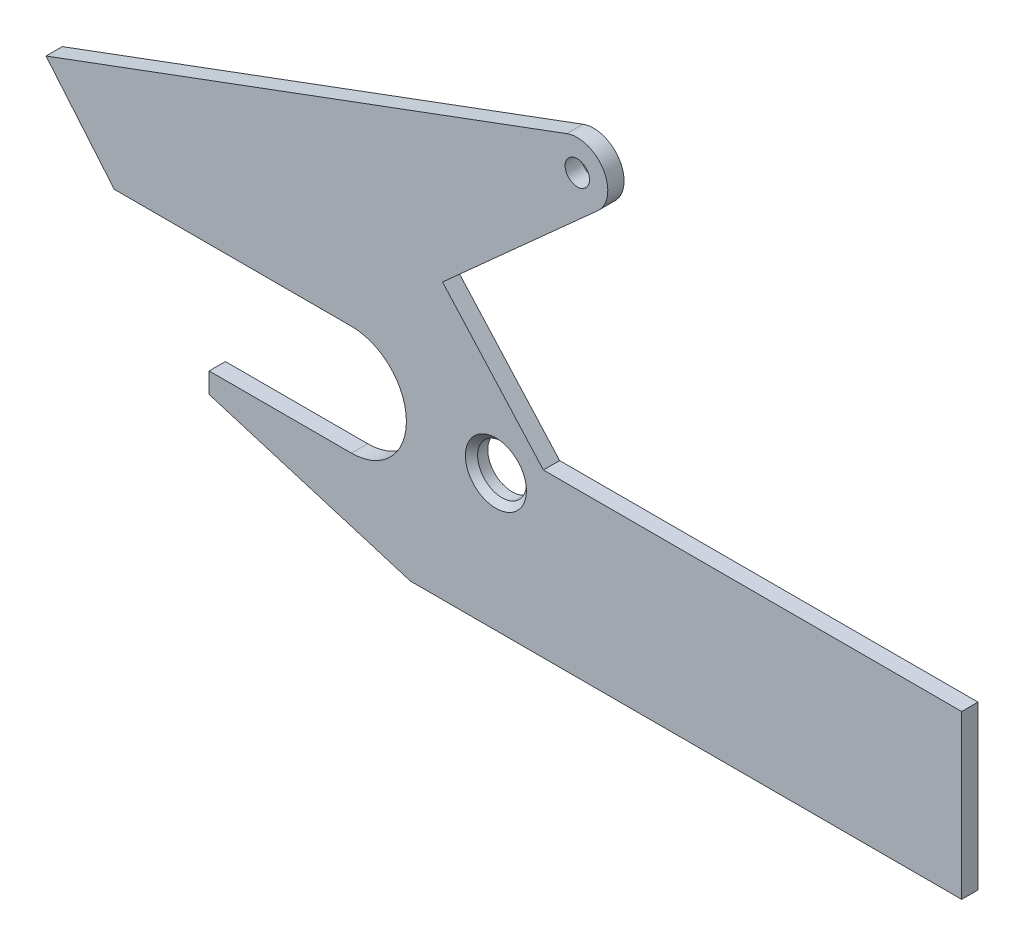
ISO-10303-21;
HEADER;
FILE_DESCRIPTION(('STEP AP214'),'2;1');
FILE_NAME('part.step','',(''),(''),'','','');
FILE_SCHEMA(('AUTOMOTIVE_DESIGN { 1 0 10303 214 1 1 1 1 }'));
ENDSEC;
DATA;
#1=APPLICATION_CONTEXT('core data for automotive mechanical design processes');
#2=APPLICATION_PROTOCOL_DEFINITION('international standard','automotive_design',2000,#1);
#3=PRODUCT_CONTEXT('',#1,'mechanical');
#4=PRODUCT('Part','Part','',(#3));
#5=PRODUCT_RELATED_PRODUCT_CATEGORY('part','',(#4));
#6=PRODUCT_DEFINITION_FORMATION('','',#4);
#7=PRODUCT_DEFINITION_CONTEXT('part definition',#1,'design');
#8=PRODUCT_DEFINITION('design','',#6,#7);
#9=PRODUCT_DEFINITION_SHAPE('','',#8);
#10=(LENGTH_UNIT() NAMED_UNIT(*) SI_UNIT(.MILLI.,.METRE.));
#11=(NAMED_UNIT(*) PLANE_ANGLE_UNIT() SI_UNIT($,.RADIAN.));
#12=(NAMED_UNIT(*) SI_UNIT($,.STERADIAN.) SOLID_ANGLE_UNIT());
#13=UNCERTAINTY_MEASURE_WITH_UNIT(LENGTH_MEASURE(1.E-05),#10,'distance_accuracy_value','');
#14=(GEOMETRIC_REPRESENTATION_CONTEXT(3) GLOBAL_UNCERTAINTY_ASSIGNED_CONTEXT((#13)) GLOBAL_UNIT_ASSIGNED_CONTEXT((#10,
#11,#12)) REPRESENTATION_CONTEXT('',''));
#15=CARTESIAN_POINT('',(0.,0.,0.));
#16=DIRECTION('',(0.,0.,1.));
#17=DIRECTION('',(1.,0.,0.));
#18=AXIS2_PLACEMENT_3D('',#15,#16,#17);
#19=CARTESIAN_POINT('',(55.4999999999125,73.9348675534564,4.));
#20=DIRECTION('',(0.,0.,1.));
#21=DIRECTION('',(1.,0.,0.));
#22=AXIS2_PLACEMENT_3D('',#19,#20,#21);
#23=PLANE('',#22);
#24=CARTESIAN_POINT('',(35.5,0.,4.));
#25=DIRECTION('',(0.,0.,1.));
#26=DIRECTION('',(1.,0.,0.));
#27=AXIS2_PLACEMENT_3D('',#24,#25,#26);
#28=CIRCLE('',#27,7.49999999999998);
#29=CARTESIAN_POINT('',(43.,0.,4.));
#30=VERTEX_POINT('',#29);
#31=EDGE_CURVE('E11',#30,#30,#28,.F.);
#32=ORIENTED_EDGE('',*,*,#31,.T.);
#33=EDGE_LOOP('',(#32));
#34=FACE_BOUND('',#33,.T.);
#35=CARTESIAN_POINT('',(55.4999999999125,73.9348675534564,4.));
#36=DIRECTION('',(0.,0.,1.));
#37=DIRECTION('',(1.,0.,0.));
#38=AXIS2_PLACEMENT_3D('',#35,#36,#37);
#39=CIRCLE('',#38,3.);
#40=CARTESIAN_POINT('',(58.4999999999125,73.9348675534564,4.));
#41=VERTEX_POINT('',#40);
#42=EDGE_CURVE('E169',#41,#41,#39,.T.);
#43=ORIENTED_EDGE('',*,*,#42,.F.);
#44=EDGE_LOOP('',(#43));
#45=FACE_BOUND('',#44,.T.);
#46=CARTESIAN_POINT('',(55.4999999999125,73.9348675534564,4.));
#47=DIRECTION('',(0.,0.,1.));
#48=DIRECTION('',(1.,0.,0.));
#49=AXIS2_PLACEMENT_3D('',#46,#47,#48);
#50=CIRCLE('',#49,7.50000000000001);
#51=CARTESIAN_POINT('',(60.5098617885871,68.3535339441495,4.));
#52=VERTEX_POINT('',#51);
#53=CARTESIAN_POINT('',(52.8919610956102,80.9668042051652,4.));
#54=VERTEX_POINT('',#53);
#55=EDGE_CURVE('E190',#52,#54,#50,.T.);
#56=ORIENTED_EDGE('',*,*,#55,.T.);
#57=DIRECTION('',(-0.937591553564827,-0.347738520563792,0.));
#58=VECTOR('',#57,1.);
#59=CARTESIAN_POINT('',(-75.0906237078958,33.4999999999755,4.));
#60=LINE('',#59,#58);
#61=CARTESIAN_POINT('',(-75.0906237078958,33.4999999999755,4.));
#62=VERTEX_POINT('',#61);
#63=EDGE_CURVE('E114',#54,#62,#60,.T.);
#64=ORIENTED_EDGE('',*,*,#63,.T.);
#65=DIRECTION('',(0.642787609686544,-0.766044443118974,0.));
#66=VECTOR('',#65,1.);
#67=CARTESIAN_POINT('',(-58.3086310843706,13.5000000000001,4.));
#68=LINE('',#67,#66);
#69=CARTESIAN_POINT('',(-58.3086310843706,13.5000000000001,4.));
#70=VERTEX_POINT('',#69);
#71=EDGE_CURVE('E301',#62,#70,#68,.T.);
#72=ORIENTED_EDGE('',*,*,#71,.T.);
#73=DIRECTION('',(1.,0.,0.));
#74=VECTOR('',#73,1.);
#75=CARTESIAN_POINT('',(0.,13.5,4.));
#76=LINE('',#75,#74);
#77=CARTESIAN_POINT('',(0.,13.5,4.));
#78=VERTEX_POINT('',#77);
#79=EDGE_CURVE('E303',#70,#78,#76,.T.);
#80=ORIENTED_EDGE('',*,*,#79,.T.);
#81=CARTESIAN_POINT('',(0.,0.,4.));
#82=DIRECTION('',(0.,0.,-1.));
#83=DIRECTION('',(1.,0.,0.));
#84=AXIS2_PLACEMENT_3D('',#81,#82,#83);
#85=CIRCLE('',#84,13.5);
#86=CARTESIAN_POINT('',(-2.27179386413923E-11,-13.5,4.));
#87=VERTEX_POINT('',#86);
#88=EDGE_CURVE('E305',#78,#87,#85,.T.);
#89=ORIENTED_EDGE('',*,*,#88,.T.);
#90=DIRECTION('',(-1.,0.,0.));
#91=VECTOR('',#90,1.);
#92=CARTESIAN_POINT('',(-35.,-13.5,4.));
#93=LINE('',#92,#91);
#94=CARTESIAN_POINT('',(-35.,-13.5,4.));
#95=VERTEX_POINT('',#94);
#96=EDGE_CURVE('E311',#87,#95,#93,.T.);
#97=ORIENTED_EDGE('',*,*,#96,.T.);
#98=DIRECTION('',(0.,-1.,0.));
#99=VECTOR('',#98,1.);
#100=CARTESIAN_POINT('',(-35.,-18.5,4.));
#101=LINE('',#100,#99);
#102=CARTESIAN_POINT('',(-35.,-18.5,4.));
#103=VERTEX_POINT('',#102);
#104=EDGE_CURVE('E313',#95,#103,#101,.T.);
#105=ORIENTED_EDGE('',*,*,#104,.T.);
#106=DIRECTION('',(0.957024404433605,-0.290007395282436,0.));
#107=VECTOR('',#106,1.);
#108=CARTESIAN_POINT('',(14.5,-33.4999999999754,4.));
#109=LINE('',#108,#107);
#110=CARTESIAN_POINT('',(14.5,-33.4999999999754,4.));
#111=VERTEX_POINT('',#110);
#112=EDGE_CURVE('E315',#103,#111,#109,.T.);
#113=ORIENTED_EDGE('',*,*,#112,.T.);
#114=DIRECTION('',(1.,1.80872127443545E-13,0.));
#115=VECTOR('',#114,1.);
#116=CARTESIAN_POINT('',(150.,-33.4999999999509,4.));
#117=LINE('',#116,#115);
#118=CARTESIAN_POINT('',(150.,-33.4999999999509,4.));
#119=VERTEX_POINT('',#118);
#120=EDGE_CURVE('E317',#111,#119,#117,.T.);
#121=ORIENTED_EDGE('',*,*,#120,.T.);
#122=DIRECTION('',(0.,1.,0.));
#123=VECTOR('',#122,1.);
#124=CARTESIAN_POINT('',(150.,6.50000000004908,4.));
#125=LINE('',#124,#123);
#126=CARTESIAN_POINT('',(150.,6.50000000004908,4.));
#127=VERTEX_POINT('',#126);
#128=EDGE_CURVE('E147',#119,#127,#125,.T.);
#129=ORIENTED_EDGE('',*,*,#128,.T.);
#130=DIRECTION('',(-1.,-2.38340446838385E-13,0.));
#131=VECTOR('',#130,1.);
#132=CARTESIAN_POINT('',(47.1715728752539,6.50000000002457,4.));
#133=LINE('',#132,#131);
#134=CARTESIAN_POINT('',(47.1715728752539,6.50000000002457,4.));
#135=VERTEX_POINT('',#134);
#136=EDGE_CURVE('E142',#127,#135,#133,.T.);
#137=ORIENTED_EDGE('',*,*,#136,.T.);
#138=DIRECTION('',(-0.667981571845495,0.744177814554305,0.));
#139=VECTOR('',#138,1.);
#140=CARTESIAN_POINT('',(22.3758988581383,34.1241011402371,4.));
#141=LINE('',#140,#139);
#142=CARTESIAN_POINT('',(22.3758988581383,34.1241011402371,4.));
#143=VERTEX_POINT('',#142);
#144=EDGE_CURVE('E145',#135,#143,#141,.T.);
#145=ORIENTED_EDGE('',*,*,#144,.T.);
#146=DIRECTION('',(0.74417781457425,0.667981571823274,0.));
#147=VECTOR('',#146,1.);
#148=CARTESIAN_POINT('',(60.5098617885871,68.3535339441495,4.));
#149=LINE('',#148,#147);
#150=EDGE_CURVE('E55',#143,#52,#149,.T.);
#151=ORIENTED_EDGE('',*,*,#150,.T.);
#152=EDGE_LOOP('',(#56,#64,#72,#80,#89,#97,#105,#113,#121,#129,#137,#145,#151));
#153=FACE_BOUND('',#152,.T.);
#154=ADVANCED_FACE('F38',(#34,#45,#153),#23,.T.);
#155=CARTESIAN_POINT('',(55.4999999999125,73.9348675534564,0.));
#156=DIRECTION('',(0.,0.,1.));
#157=DIRECTION('',(1.,0.,0.));
#158=AXIS2_PLACEMENT_3D('',#155,#156,#157);
#159=PLANE('',#158);
#160=CARTESIAN_POINT('',(55.4999999999125,73.9348675534564,0.));
#161=DIRECTION('',(0.,0.,1.));
#162=DIRECTION('',(1.,0.,0.));
#163=AXIS2_PLACEMENT_3D('',#160,#161,#162);
#164=CIRCLE('',#163,7.50000000000001);
#165=CARTESIAN_POINT('',(60.5098617885871,68.3535339441495,0.));
#166=VERTEX_POINT('',#165);
#167=CARTESIAN_POINT('',(52.8919610956102,80.9668042051652,0.));
#168=VERTEX_POINT('',#167);
#169=EDGE_CURVE('E165',#166,#168,#164,.T.);
#170=ORIENTED_EDGE('',*,*,#169,.F.);
#171=DIRECTION('',(0.74417781457425,0.667981571823274,0.));
#172=VECTOR('',#171,1.);
#173=CARTESIAN_POINT('',(60.5098617885871,68.3535339441495,0.));
#174=LINE('',#173,#172);
#175=CARTESIAN_POINT('',(22.3758988581383,34.1241011402371,0.));
#176=VERTEX_POINT('',#175);
#177=EDGE_CURVE('E105',#176,#166,#174,.T.);
#178=ORIENTED_EDGE('',*,*,#177,.F.);
#179=DIRECTION('',(-0.667981571845495,0.744177814554305,0.));
#180=VECTOR('',#179,1.);
#181=CARTESIAN_POINT('',(22.3758988581383,34.1241011402371,0.));
#182=LINE('',#181,#180);
#183=CARTESIAN_POINT('',(47.1715728752539,6.50000000002457,0.));
#184=VERTEX_POINT('',#183);
#185=EDGE_CURVE('E99',#184,#176,#182,.T.);
#186=ORIENTED_EDGE('',*,*,#185,.F.);
#187=DIRECTION('',(-1.,-2.38340446838385E-13,0.));
#188=VECTOR('',#187,1.);
#189=CARTESIAN_POINT('',(47.1715728752539,6.50000000002457,0.));
#190=LINE('',#189,#188);
#191=CARTESIAN_POINT('',(150.,6.50000000004908,0.));
#192=VERTEX_POINT('',#191);
#193=EDGE_CURVE('E155',#192,#184,#190,.T.);
#194=ORIENTED_EDGE('',*,*,#193,.F.);
#195=DIRECTION('',(0.,1.,0.));
#196=VECTOR('',#195,1.);
#197=CARTESIAN_POINT('',(150.,6.50000000004908,0.));
#198=LINE('',#197,#196);
#199=CARTESIAN_POINT('',(150.,-33.4999999999509,0.));
#200=VERTEX_POINT('',#199);
#201=EDGE_CURVE('E185',#200,#192,#198,.T.);
#202=ORIENTED_EDGE('',*,*,#201,.F.);
#203=DIRECTION('',(1.,1.80872127443545E-13,0.));
#204=VECTOR('',#203,1.);
#205=CARTESIAN_POINT('',(150.,-33.4999999999509,0.));
#206=LINE('',#205,#204);
#207=CARTESIAN_POINT('',(14.5,-33.4999999999754,0.));
#208=VERTEX_POINT('',#207);
#209=EDGE_CURVE('E183',#208,#200,#206,.T.);
#210=ORIENTED_EDGE('',*,*,#209,.F.);
#211=DIRECTION('',(0.957024404433605,-0.290007395282436,0.));
#212=VECTOR('',#211,1.);
#213=CARTESIAN_POINT('',(14.5,-33.4999999999754,0.));
#214=LINE('',#213,#212);
#215=CARTESIAN_POINT('',(-35.,-18.5,0.));
#216=VERTEX_POINT('',#215);
#217=EDGE_CURVE('E181',#216,#208,#214,.T.);
#218=ORIENTED_EDGE('',*,*,#217,.F.);
#219=DIRECTION('',(0.,-1.,0.));
#220=VECTOR('',#219,1.);
#221=CARTESIAN_POINT('',(-35.,-18.5,0.));
#222=LINE('',#221,#220);
#223=CARTESIAN_POINT('',(-35.,-13.5,0.));
#224=VERTEX_POINT('',#223);
#225=EDGE_CURVE('E179',#224,#216,#222,.T.);
#226=ORIENTED_EDGE('',*,*,#225,.F.);
#227=DIRECTION('',(-1.,0.,0.));
#228=VECTOR('',#227,1.);
#229=CARTESIAN_POINT('',(-35.,-13.5,0.));
#230=LINE('',#229,#228);
#231=CARTESIAN_POINT('',(-2.27179386413923E-11,-13.5,0.));
#232=VERTEX_POINT('',#231);
#233=EDGE_CURVE('E177',#232,#224,#230,.T.);
#234=ORIENTED_EDGE('',*,*,#233,.F.);
#235=CARTESIAN_POINT('',(0.,0.,0.));
#236=DIRECTION('',(0.,0.,-1.));
#237=DIRECTION('',(1.,0.,0.));
#238=AXIS2_PLACEMENT_3D('',#235,#236,#237);
#239=CIRCLE('',#238,13.5);
#240=CARTESIAN_POINT('',(0.,13.5,0.));
#241=VERTEX_POINT('',#240);
#242=EDGE_CURVE('E175',#241,#232,#239,.T.);
#243=ORIENTED_EDGE('',*,*,#242,.F.);
#244=DIRECTION('',(1.,0.,0.));
#245=VECTOR('',#244,1.);
#246=CARTESIAN_POINT('',(0.,13.5,0.));
#247=LINE('',#246,#245);
#248=CARTESIAN_POINT('',(-58.3086310843706,13.5000000000001,0.));
#249=VERTEX_POINT('',#248);
#250=EDGE_CURVE('E173',#249,#241,#247,.T.);
#251=ORIENTED_EDGE('',*,*,#250,.F.);
#252=DIRECTION('',(0.642787609686544,-0.766044443118974,0.));
#253=VECTOR('',#252,1.);
#254=CARTESIAN_POINT('',(-58.3086310843706,13.5000000000001,0.));
#255=LINE('',#254,#253);
#256=CARTESIAN_POINT('',(-75.0906237078958,33.4999999999755,0.));
#257=VERTEX_POINT('',#256);
#258=EDGE_CURVE('E171',#257,#249,#255,.T.);
#259=ORIENTED_EDGE('',*,*,#258,.F.);
#260=DIRECTION('',(-0.937591553564827,-0.347738520563792,0.));
#261=VECTOR('',#260,1.);
#262=CARTESIAN_POINT('',(-75.0906237078958,33.4999999999755,0.));
#263=LINE('',#262,#261);
#264=EDGE_CURVE('E168',#168,#257,#263,.T.);
#265=ORIENTED_EDGE('',*,*,#264,.F.);
#266=EDGE_LOOP('',(#170,#178,#186,#194,#202,#210,#218,#226,#234,#243,#251,#259,#265));
#267=FACE_BOUND('',#266,.T.);
#268=CARTESIAN_POINT('',(55.4999999999125,73.9348675534564,0.));
#269=DIRECTION('',(0.,0.,1.));
#270=DIRECTION('',(1.,0.,0.));
#271=AXIS2_PLACEMENT_3D('',#268,#269,#270);
#272=CIRCLE('',#271,3.);
#273=CARTESIAN_POINT('',(58.4999999999125,73.9348675534564,0.));
#274=VERTEX_POINT('',#273);
#275=EDGE_CURVE('E336',#274,#274,#272,.T.);
#276=ORIENTED_EDGE('',*,*,#275,.T.);
#277=EDGE_LOOP('',(#276));
#278=FACE_BOUND('',#277,.T.);
#279=CARTESIAN_POINT('',(35.5,0.,0.));
#280=DIRECTION('',(0.,0.,1.));
#281=DIRECTION('',(1.,0.,0.));
#282=AXIS2_PLACEMENT_3D('',#279,#280,#281);
#283=CIRCLE('',#282,6.);
#284=CARTESIAN_POINT('',(41.5,0.,0.));
#285=VERTEX_POINT('',#284);
#286=EDGE_CURVE('E339',#285,#285,#283,.T.);
#287=ORIENTED_EDGE('',*,*,#286,.T.);
#288=EDGE_LOOP('',(#287));
#289=FACE_BOUND('',#288,.T.);
#290=ADVANCED_FACE('F235',(#267,#278,#289),#159,.F.);
#291=CARTESIAN_POINT('',(55.4999999999125,73.9348675534564,4.));
#292=DIRECTION('',(0.,0.,-1.));
#293=DIRECTION('',(-1.,0.,0.));
#294=AXIS2_PLACEMENT_3D('',#291,#292,#293);
#295=CYLINDRICAL_SURFACE('',#294,7.50000000000001);
#296=ORIENTED_EDGE('',*,*,#169,.T.);
#297=DIRECTION('',(0.,0.,-1.));
#298=VECTOR('',#297,1.);
#299=CARTESIAN_POINT('',(52.8919610956102,80.9668042051652,4.));
#300=LINE('',#299,#298);
#301=EDGE_CURVE('E218',#54,#168,#300,.T.);
#302=ORIENTED_EDGE('',*,*,#301,.F.);
#303=ORIENTED_EDGE('',*,*,#55,.F.);
#304=DIRECTION('',(0.,0.,-1.));
#305=VECTOR('',#304,1.);
#306=CARTESIAN_POINT('',(60.5098617885871,68.3535339441495,4.));
#307=LINE('',#306,#305);
#308=EDGE_CURVE('E161',#52,#166,#307,.T.);
#309=ORIENTED_EDGE('',*,*,#308,.T.);
#310=EDGE_LOOP('',(#296,#302,#303,#309));
#311=FACE_BOUND('',#310,.T.);
#312=ADVANCED_FACE('F242',(#311),#295,.T.);
#313=CARTESIAN_POINT('',(-75.0906237078958,33.4999999999755,4.));
#314=DIRECTION('',(0.347738520563792,-0.937591553564827,0.));
#315=DIRECTION('',(0.937591553564827,0.347738520563792,0.));
#316=AXIS2_PLACEMENT_3D('',#313,#314,#315);
#317=PLANE('',#316);
#318=ORIENTED_EDGE('',*,*,#264,.T.);
#319=DIRECTION('',(0.,0.,-1.));
#320=VECTOR('',#319,1.);
#321=CARTESIAN_POINT('',(-75.0906237078958,33.4999999999755,4.));
#322=LINE('',#321,#320);
#323=EDGE_CURVE('E215',#62,#257,#322,.T.);
#324=ORIENTED_EDGE('',*,*,#323,.F.);
#325=ORIENTED_EDGE('',*,*,#63,.F.);
#326=ORIENTED_EDGE('',*,*,#301,.T.);
#327=EDGE_LOOP('',(#318,#324,#325,#326));
#328=FACE_BOUND('',#327,.T.);
#329=ADVANCED_FACE('F286',(#328),#317,.F.);
#330=CARTESIAN_POINT('',(-58.3086310843706,13.5000000000001,4.));
#331=DIRECTION('',(0.766044443118974,0.642787609686544,0.));
#332=DIRECTION('',(-0.642787609686544,0.766044443118974,0.));
#333=AXIS2_PLACEMENT_3D('',#330,#331,#332);
#334=PLANE('',#333);
#335=ORIENTED_EDGE('',*,*,#258,.T.);
#336=DIRECTION('',(0.,0.,-1.));
#337=VECTOR('',#336,1.);
#338=CARTESIAN_POINT('',(-58.3086310843706,13.5000000000001,4.));
#339=LINE('',#338,#337);
#340=EDGE_CURVE('E212',#70,#249,#339,.T.);
#341=ORIENTED_EDGE('',*,*,#340,.F.);
#342=ORIENTED_EDGE('',*,*,#71,.F.);
#343=ORIENTED_EDGE('',*,*,#323,.T.);
#344=EDGE_LOOP('',(#335,#341,#342,#343));
#345=FACE_BOUND('',#344,.T.);
#346=ADVANCED_FACE('F282',(#345),#334,.F.);
#347=CARTESIAN_POINT('',(0.,13.5,4.));
#348=DIRECTION('',(0.,1.,0.));
#349=DIRECTION('',(-1.,0.,0.));
#350=AXIS2_PLACEMENT_3D('',#347,#348,#349);
#351=PLANE('',#350);
#352=ORIENTED_EDGE('',*,*,#250,.T.);
#353=DIRECTION('',(0.,0.,-1.));
#354=VECTOR('',#353,1.);
#355=CARTESIAN_POINT('',(0.,13.5,4.));
#356=LINE('',#355,#354);
#357=EDGE_CURVE('E209',#78,#241,#356,.T.);
#358=ORIENTED_EDGE('',*,*,#357,.F.);
#359=ORIENTED_EDGE('',*,*,#79,.F.);
#360=ORIENTED_EDGE('',*,*,#340,.T.);
#361=EDGE_LOOP('',(#352,#358,#359,#360));
#362=FACE_BOUND('',#361,.T.);
#363=ADVANCED_FACE('F278',(#362),#351,.F.);
#364=CARTESIAN_POINT('',(0.,0.,4.));
#365=DIRECTION('',(0.,0.,-1.));
#366=DIRECTION('',(-1.,0.,0.));
#367=AXIS2_PLACEMENT_3D('',#364,#365,#366);
#368=CYLINDRICAL_SURFACE('',#367,13.5);
#369=ORIENTED_EDGE('',*,*,#242,.T.);
#370=DIRECTION('',(0.,0.,-1.));
#371=VECTOR('',#370,1.);
#372=CARTESIAN_POINT('',(-2.27179386413923E-11,-13.5,4.));
#373=LINE('',#372,#371);
#374=EDGE_CURVE('E206',#87,#232,#373,.T.);
#375=ORIENTED_EDGE('',*,*,#374,.F.);
#376=ORIENTED_EDGE('',*,*,#88,.F.);
#377=ORIENTED_EDGE('',*,*,#357,.T.);
#378=EDGE_LOOP('',(#369,#375,#376,#377));
#379=FACE_BOUND('',#378,.T.);
#380=ADVANCED_FACE('F274',(#379),#368,.F.);
#381=CARTESIAN_POINT('',(-35.,-13.5,4.));
#382=DIRECTION('',(0.,-1.,0.));
#383=DIRECTION('',(1.,0.,0.));
#384=AXIS2_PLACEMENT_3D('',#381,#382,#383);
#385=PLANE('',#384);
#386=ORIENTED_EDGE('',*,*,#233,.T.);
#387=DIRECTION('',(0.,0.,-1.));
#388=VECTOR('',#387,1.);
#389=CARTESIAN_POINT('',(-35.,-13.5,4.));
#390=LINE('',#389,#388);
#391=EDGE_CURVE('E203',#95,#224,#390,.T.);
#392=ORIENTED_EDGE('',*,*,#391,.F.);
#393=ORIENTED_EDGE('',*,*,#96,.F.);
#394=ORIENTED_EDGE('',*,*,#374,.T.);
#395=EDGE_LOOP('',(#386,#392,#393,#394));
#396=FACE_BOUND('',#395,.T.);
#397=ADVANCED_FACE('F270',(#396),#385,.F.);
#398=CARTESIAN_POINT('',(-35.,-18.5,4.));
#399=DIRECTION('',(1.,0.,0.));
#400=DIRECTION('',(0.,1.,0.));
#401=AXIS2_PLACEMENT_3D('',#398,#399,#400);
#402=PLANE('',#401);
#403=ORIENTED_EDGE('',*,*,#225,.T.);
#404=DIRECTION('',(0.,0.,-1.));
#405=VECTOR('',#404,1.);
#406=CARTESIAN_POINT('',(-35.,-18.5,4.));
#407=LINE('',#406,#405);
#408=EDGE_CURVE('E200',#103,#216,#407,.T.);
#409=ORIENTED_EDGE('',*,*,#408,.F.);
#410=ORIENTED_EDGE('',*,*,#104,.F.);
#411=ORIENTED_EDGE('',*,*,#391,.T.);
#412=EDGE_LOOP('',(#403,#409,#410,#411));
#413=FACE_BOUND('',#412,.T.);
#414=ADVANCED_FACE('F266',(#413),#402,.F.);
#415=CARTESIAN_POINT('',(14.5,-33.4999999999754,4.));
#416=DIRECTION('',(0.290007395282436,0.957024404433605,0.));
#417=DIRECTION('',(-0.957024404433605,0.290007395282436,0.));
#418=AXIS2_PLACEMENT_3D('',#415,#416,#417);
#419=PLANE('',#418);
#420=ORIENTED_EDGE('',*,*,#217,.T.);
#421=DIRECTION('',(0.,0.,-1.));
#422=VECTOR('',#421,1.);
#423=CARTESIAN_POINT('',(14.5,-33.4999999999754,4.));
#424=LINE('',#423,#422);
#425=EDGE_CURVE('E197',#111,#208,#424,.T.);
#426=ORIENTED_EDGE('',*,*,#425,.F.);
#427=ORIENTED_EDGE('',*,*,#112,.F.);
#428=ORIENTED_EDGE('',*,*,#408,.T.);
#429=EDGE_LOOP('',(#420,#426,#427,#428));
#430=FACE_BOUND('',#429,.T.);
#431=ADVANCED_FACE('F262',(#430),#419,.F.);
#432=CARTESIAN_POINT('',(150.,-33.4999999999509,4.));
#433=DIRECTION('',(-1.80872127443545E-13,1.,0.));
#434=DIRECTION('',(-1.,-1.80872127443545E-13,0.));
#435=AXIS2_PLACEMENT_3D('',#432,#433,#434);
#436=PLANE('',#435);
#437=ORIENTED_EDGE('',*,*,#209,.T.);
#438=DIRECTION('',(0.,0.,-1.));
#439=VECTOR('',#438,1.);
#440=CARTESIAN_POINT('',(150.,-33.4999999999509,4.));
#441=LINE('',#440,#439);
#442=EDGE_CURVE('E194',#119,#200,#441,.T.);
#443=ORIENTED_EDGE('',*,*,#442,.F.);
#444=ORIENTED_EDGE('',*,*,#120,.F.);
#445=ORIENTED_EDGE('',*,*,#425,.T.);
#446=EDGE_LOOP('',(#437,#443,#444,#445));
#447=FACE_BOUND('',#446,.T.);
#448=ADVANCED_FACE('F258',(#447),#436,.F.);
#449=CARTESIAN_POINT('',(150.,6.50000000004908,4.));
#450=DIRECTION('',(-1.,0.,0.));
#451=DIRECTION('',(0.,0.,1.));
#452=AXIS2_PLACEMENT_3D('',#449,#450,#451);
#453=PLANE('',#452);
#454=ORIENTED_EDGE('',*,*,#201,.T.);
#455=DIRECTION('',(0.,0.,-1.));
#456=VECTOR('',#455,1.);
#457=CARTESIAN_POINT('',(150.,6.50000000004908,4.));
#458=LINE('',#457,#456);
#459=EDGE_CURVE('E156',#127,#192,#458,.T.);
#460=ORIENTED_EDGE('',*,*,#459,.F.);
#461=ORIENTED_EDGE('',*,*,#128,.F.);
#462=ORIENTED_EDGE('',*,*,#442,.T.);
#463=EDGE_LOOP('',(#454,#460,#461,#462));
#464=FACE_BOUND('',#463,.T.);
#465=ADVANCED_FACE('F255',(#464),#453,.F.);
#466=CARTESIAN_POINT('',(47.1715728752539,6.50000000002457,4.));
#467=DIRECTION('',(2.38340446838385E-13,-1.,0.));
#468=DIRECTION('',(1.,2.38340446838385E-13,0.));
#469=AXIS2_PLACEMENT_3D('',#466,#467,#468);
#470=PLANE('',#469);
#471=ORIENTED_EDGE('',*,*,#193,.T.);
#472=DIRECTION('',(0.,0.,-1.));
#473=VECTOR('',#472,1.);
#474=CARTESIAN_POINT('',(47.1715728752539,6.50000000002457,4.));
#475=LINE('',#474,#473);
#476=EDGE_CURVE('E152',#135,#184,#475,.T.);
#477=ORIENTED_EDGE('',*,*,#476,.F.);
#478=ORIENTED_EDGE('',*,*,#136,.F.);
#479=ORIENTED_EDGE('',*,*,#459,.T.);
#480=EDGE_LOOP('',(#471,#477,#478,#479));
#481=FACE_BOUND('',#480,.T.);
#482=ADVANCED_FACE('F153',(#481),#470,.F.);
#483=CARTESIAN_POINT('',(22.3758988581383,34.1241011402371,4.));
#484=DIRECTION('',(-0.744177814554305,-0.667981571845495,0.));
#485=DIRECTION('',(0.667981571845495,-0.744177814554306,0.));
#486=AXIS2_PLACEMENT_3D('',#483,#484,#485);
#487=PLANE('',#486);
#488=ORIENTED_EDGE('',*,*,#185,.T.);
#489=DIRECTION('',(0.,0.,-1.));
#490=VECTOR('',#489,1.);
#491=CARTESIAN_POINT('',(22.3758988581383,34.1241011402371,4.));
#492=LINE('',#491,#490);
#493=EDGE_CURVE('E157',#143,#176,#492,.T.);
#494=ORIENTED_EDGE('',*,*,#493,.F.);
#495=ORIENTED_EDGE('',*,*,#144,.F.);
#496=ORIENTED_EDGE('',*,*,#476,.T.);
#497=EDGE_LOOP('',(#488,#494,#495,#496));
#498=FACE_BOUND('',#497,.T.);
#499=ADVANCED_FACE('F159',(#498),#487,.F.);
#500=CARTESIAN_POINT('',(60.5098617885871,68.3535339441495,4.));
#501=DIRECTION('',(-0.667981571823275,0.744177814574251,0.));
#502=DIRECTION('',(-0.744177814574251,-0.667981571823275,0.));
#503=AXIS2_PLACEMENT_3D('',#500,#501,#502);
#504=PLANE('',#503);
#505=ORIENTED_EDGE('',*,*,#177,.T.);
#506=ORIENTED_EDGE('',*,*,#308,.F.);
#507=ORIENTED_EDGE('',*,*,#150,.F.);
#508=ORIENTED_EDGE('',*,*,#493,.T.);
#509=EDGE_LOOP('',(#505,#506,#507,#508));
#510=FACE_BOUND('',#509,.T.);
#511=ADVANCED_FACE('F248',(#510),#504,.F.);
#512=CARTESIAN_POINT('',(55.4999999999125,73.9348675534564,4.));
#513=DIRECTION('',(0.,0.,-1.));
#514=DIRECTION('',(-1.,0.,0.));
#515=AXIS2_PLACEMENT_3D('',#512,#513,#514);
#516=CYLINDRICAL_SURFACE('',#515,3.);
#517=ORIENTED_EDGE('',*,*,#42,.T.);
#518=EDGE_LOOP('',(#517));
#519=FACE_BOUND('',#518,.T.);
#520=ORIENTED_EDGE('',*,*,#275,.F.);
#521=EDGE_LOOP('',(#520));
#522=FACE_BOUND('',#521,.T.);
#523=ADVANCED_FACE('F231',(#519,#522),#516,.F.);
#524=CARTESIAN_POINT('',(35.5,0.,4.));
#525=DIRECTION('',(0.,0.,-1.));
#526=DIRECTION('',(-1.,0.,0.));
#527=AXIS2_PLACEMENT_3D('',#524,#525,#526);
#528=CYLINDRICAL_SURFACE('',#527,6.);
#529=CARTESIAN_POINT('',(35.5,0.,2.50000000000003));
#530=DIRECTION('',(0.,0.,1.));
#531=DIRECTION('',(1.,0.,0.));
#532=AXIS2_PLACEMENT_3D('',#529,#530,#531);
#533=CIRCLE('',#532,6.);
#534=CARTESIAN_POINT('',(41.5,0.,2.50000000000003));
#535=VERTEX_POINT('',#534);
#536=EDGE_CURVE('E47',#535,#535,#533,.T.);
#537=ORIENTED_EDGE('',*,*,#536,.T.);
#538=EDGE_LOOP('',(#537));
#539=FACE_BOUND('',#538,.T.);
#540=ORIENTED_EDGE('',*,*,#286,.F.);
#541=EDGE_LOOP('',(#540));
#542=FACE_BOUND('',#541,.T.);
#543=ADVANCED_FACE('F222',(#539,#542),#528,.F.);
#544=CARTESIAN_POINT('',(35.5,0.,2.50000000000003));
#545=DIRECTION('',(0.,0.,1.));
#546=DIRECTION('',(1.,0.,0.));
#547=AXIS2_PLACEMENT_3D('',#544,#545,#546);
#548=CONICAL_SURFACE('',#547,6.,0.785398163397451);
#549=ORIENTED_EDGE('',*,*,#31,.F.);
#550=EDGE_LOOP('',(#549));
#551=FACE_BOUND('',#550,.T.);
#552=ORIENTED_EDGE('',*,*,#536,.F.);
#553=EDGE_LOOP('',(#552));
#554=FACE_BOUND('',#553,.T.);
#555=ADVANCED_FACE('F40',(#551,#554),#548,.F.);
#556=CLOSED_SHELL('',(#154,#290,#312,#329,#346,#363,#380,#397,#414,#431,#448,#465,#482,#499,
#511,#523,#543,#555));
#557=MANIFOLD_SOLID_BREP('B2',#556);
#558=ADVANCED_BREP_SHAPE_REPRESENTATION('',(#18,#557),#14);
#559=SHAPE_DEFINITION_REPRESENTATION(#9,#558);
ENDSEC;
END-ISO-10303-21;
